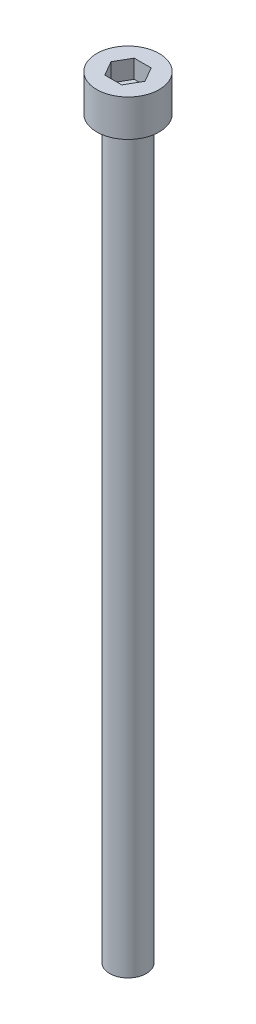
ISO-10303-21;
HEADER;
FILE_DESCRIPTION(('STEP AP214'),'2;1');
FILE_NAME('part.step','',(''),(''),'','','');
FILE_SCHEMA(('AUTOMOTIVE_DESIGN { 1 0 10303 214 1 1 1 1 }'));
ENDSEC;
DATA;
#1=APPLICATION_CONTEXT('core data for automotive mechanical design processes');
#2=APPLICATION_PROTOCOL_DEFINITION('international standard','automotive_design',2000,#1);
#3=PRODUCT_CONTEXT('',#1,'mechanical');
#4=PRODUCT('Part','Part','',(#3));
#5=PRODUCT_RELATED_PRODUCT_CATEGORY('part','',(#4));
#6=PRODUCT_DEFINITION_FORMATION('','',#4);
#7=PRODUCT_DEFINITION_CONTEXT('part definition',#1,'design');
#8=PRODUCT_DEFINITION('design','',#6,#7);
#9=PRODUCT_DEFINITION_SHAPE('','',#8);
#10=(LENGTH_UNIT() NAMED_UNIT(*) SI_UNIT(.MILLI.,.METRE.));
#11=(NAMED_UNIT(*) PLANE_ANGLE_UNIT() SI_UNIT($,.RADIAN.));
#12=(NAMED_UNIT(*) SI_UNIT($,.STERADIAN.) SOLID_ANGLE_UNIT());
#13=UNCERTAINTY_MEASURE_WITH_UNIT(LENGTH_MEASURE(1.E-05),#10,'distance_accuracy_value','');
#14=(GEOMETRIC_REPRESENTATION_CONTEXT(3) GLOBAL_UNCERTAINTY_ASSIGNED_CONTEXT((#13)) GLOBAL_UNIT_ASSIGNED_CONTEXT((#10,
#11,#12)) REPRESENTATION_CONTEXT('',''));
#15=CARTESIAN_POINT('',(0.,0.,0.));
#16=DIRECTION('',(0.,0.,1.));
#17=DIRECTION('',(1.,0.,0.));
#18=AXIS2_PLACEMENT_3D('',#15,#16,#17);
#19=CARTESIAN_POINT('',(0.,5.,0.));
#20=DIRECTION('',(0.,-1.,0.));
#21=DIRECTION('',(0.,0.,-1.));
#22=AXIS2_PLACEMENT_3D('',#19,#20,#21);
#23=CYLINDRICAL_SURFACE('',#22,4.25);
#24=CARTESIAN_POINT('',(0.,5.,0.));
#25=DIRECTION('',(0.,1.,0.));
#26=DIRECTION('',(0.,0.,1.));
#27=AXIS2_PLACEMENT_3D('',#24,#25,#26);
#28=CIRCLE('',#27,4.25);
#29=CARTESIAN_POINT('',(0.,5.,4.25));
#30=VERTEX_POINT('',#29);
#31=EDGE_CURVE('E43',#30,#30,#28,.T.);
#32=ORIENTED_EDGE('',*,*,#31,.F.);
#33=EDGE_LOOP('',(#32));
#34=FACE_BOUND('',#33,.T.);
#35=CARTESIAN_POINT('',(0.,0.,0.));
#36=DIRECTION('',(0.,1.,0.));
#37=DIRECTION('',(0.,0.,1.));
#38=AXIS2_PLACEMENT_3D('',#35,#36,#37);
#39=CIRCLE('',#38,4.25);
#40=CARTESIAN_POINT('',(0.,0.,4.25));
#41=VERTEX_POINT('',#40);
#42=EDGE_CURVE('E38',#41,#41,#39,.T.);
#43=ORIENTED_EDGE('',*,*,#42,.T.);
#44=EDGE_LOOP('',(#43));
#45=FACE_BOUND('',#44,.T.);
#46=ADVANCED_FACE('F35',(#34,#45),#23,.T.);
#47=CARTESIAN_POINT('',(0.,5.,0.));
#48=DIRECTION('',(0.,1.,0.));
#49=DIRECTION('',(0.,0.,1.));
#50=AXIS2_PLACEMENT_3D('',#47,#48,#49);
#51=PLANE('',#50);
#52=DIRECTION('',(0.5,0.,-0.866025403784439));
#53=VECTOR('',#52,1.);
#54=CARTESIAN_POINT('',(1.15470053837925,5.,2.));
#55=LINE('',#54,#53);
#56=CARTESIAN_POINT('',(1.15470053837925,5.,2.));
#57=VERTEX_POINT('',#56);
#58=CARTESIAN_POINT('',(2.3094010767585,5.,0.));
#59=VERTEX_POINT('',#58);
#60=EDGE_CURVE('E51',#57,#59,#55,.T.);
#61=ORIENTED_EDGE('',*,*,#60,.F.);
#62=DIRECTION('',(1.,0.,0.));
#63=VECTOR('',#62,1.);
#64=CARTESIAN_POINT('',(-1.15470053837925,5.,2.));
#65=LINE('',#64,#63);
#66=CARTESIAN_POINT('',(-1.15470053837925,5.,2.));
#67=VERTEX_POINT('',#66);
#68=EDGE_CURVE('E135',#67,#57,#65,.T.);
#69=ORIENTED_EDGE('',*,*,#68,.F.);
#70=DIRECTION('',(0.5,0.,0.866025403784438));
#71=VECTOR('',#70,1.);
#72=CARTESIAN_POINT('',(-2.3094010767585,5.,0.));
#73=LINE('',#72,#71);
#74=CARTESIAN_POINT('',(-2.3094010767585,5.,0.));
#75=VERTEX_POINT('',#74);
#76=EDGE_CURVE('E133',#75,#67,#73,.T.);
#77=ORIENTED_EDGE('',*,*,#76,.F.);
#78=DIRECTION('',(-0.5,0.,0.866025403784439));
#79=VECTOR('',#78,1.);
#80=CARTESIAN_POINT('',(-1.15470053837925,5.,-2.));
#81=LINE('',#80,#79);
#82=CARTESIAN_POINT('',(-1.15470053837925,5.,-2.));
#83=VERTEX_POINT('',#82);
#84=EDGE_CURVE('E99',#83,#75,#81,.T.);
#85=ORIENTED_EDGE('',*,*,#84,.F.);
#86=DIRECTION('',(-1.,0.,0.));
#87=VECTOR('',#86,1.);
#88=CARTESIAN_POINT('',(1.15470053837925,5.,-2.));
#89=LINE('',#88,#87);
#90=CARTESIAN_POINT('',(1.15470053837925,5.,-2.));
#91=VERTEX_POINT('',#90);
#92=EDGE_CURVE('E129',#91,#83,#89,.T.);
#93=ORIENTED_EDGE('',*,*,#92,.F.);
#94=DIRECTION('',(-0.5,0.,-0.866025403784438));
#95=VECTOR('',#94,1.);
#96=CARTESIAN_POINT('',(2.3094010767585,5.,0.));
#97=LINE('',#96,#95);
#98=EDGE_CURVE('E125',#59,#91,#97,.T.);
#99=ORIENTED_EDGE('',*,*,#98,.F.);
#100=EDGE_LOOP('',(#61,#69,#77,#85,#93,#99));
#101=FACE_BOUND('',#100,.T.);
#102=ORIENTED_EDGE('',*,*,#31,.T.);
#103=EDGE_LOOP('',(#102));
#104=FACE_BOUND('',#103,.T.);
#105=ADVANCED_FACE('F153',(#101,#104),#51,.T.);
#106=CARTESIAN_POINT('',(0.,0.,0.));
#107=DIRECTION('',(0.,1.,0.));
#108=DIRECTION('',(0.,0.,1.));
#109=AXIS2_PLACEMENT_3D('',#106,#107,#108);
#110=PLANE('',#109);
#111=CARTESIAN_POINT('',(0.,0.,0.));
#112=DIRECTION('',(0.,-1.,0.));
#113=DIRECTION('',(0.,0.,-1.));
#114=AXIS2_PLACEMENT_3D('',#111,#112,#113);
#115=CIRCLE('',#114,2.5);
#116=CARTESIAN_POINT('',(0.,0.,-2.5));
#117=VERTEX_POINT('',#116);
#118=EDGE_CURVE('E11',#117,#117,#115,.T.);
#119=ORIENTED_EDGE('',*,*,#118,.F.);
#120=EDGE_LOOP('',(#119));
#121=FACE_BOUND('',#120,.T.);
#122=ORIENTED_EDGE('',*,*,#42,.F.);
#123=EDGE_LOOP('',(#122));
#124=FACE_BOUND('',#123,.T.);
#125=ADVANCED_FACE('F150',(#121,#124),#110,.F.);
#126=CARTESIAN_POINT('',(1.15470053837925,2.5,2.));
#127=DIRECTION('',(0.866025403784439,0.,0.5));
#128=DIRECTION('',(0.5,0.,-0.866025403784439));
#129=AXIS2_PLACEMENT_3D('',#126,#127,#128);
#130=PLANE('',#129);
#131=ORIENTED_EDGE('',*,*,#60,.T.);
#132=DIRECTION('',(0.,1.,0.));
#133=VECTOR('',#132,1.);
#134=CARTESIAN_POINT('',(2.3094010767585,2.5,0.));
#135=LINE('',#134,#133);
#136=CARTESIAN_POINT('',(2.3094010767585,2.5,0.));
#137=VERTEX_POINT('',#136);
#138=EDGE_CURVE('E81',#137,#59,#135,.T.);
#139=ORIENTED_EDGE('',*,*,#138,.F.);
#140=DIRECTION('',(0.5,0.,-0.866025403784439));
#141=VECTOR('',#140,1.);
#142=CARTESIAN_POINT('',(1.15470053837925,2.5,2.));
#143=LINE('',#142,#141);
#144=CARTESIAN_POINT('',(1.15470053837925,2.5,2.));
#145=VERTEX_POINT('',#144);
#146=EDGE_CURVE('E137',#145,#137,#143,.T.);
#147=ORIENTED_EDGE('',*,*,#146,.F.);
#148=DIRECTION('',(0.,1.,0.));
#149=VECTOR('',#148,1.);
#150=CARTESIAN_POINT('',(1.15470053837925,2.5,2.));
#151=LINE('',#150,#149);
#152=EDGE_CURVE('E59',#145,#57,#151,.T.);
#153=ORIENTED_EDGE('',*,*,#152,.T.);
#154=EDGE_LOOP('',(#131,#139,#147,#153));
#155=FACE_BOUND('',#154,.T.);
#156=ADVANCED_FACE('F152',(#155),#130,.F.);
#157=CARTESIAN_POINT('',(-1.15470053837925,2.5,2.));
#158=DIRECTION('',(0.,0.,1.));
#159=DIRECTION('',(1.,0.,0.));
#160=AXIS2_PLACEMENT_3D('',#157,#158,#159);
#161=PLANE('',#160);
#162=ORIENTED_EDGE('',*,*,#68,.T.);
#163=ORIENTED_EDGE('',*,*,#152,.F.);
#164=DIRECTION('',(1.,0.,0.));
#165=VECTOR('',#164,1.);
#166=CARTESIAN_POINT('',(-1.15470053837925,2.5,2.));
#167=LINE('',#166,#165);
#168=CARTESIAN_POINT('',(-1.15470053837925,2.5,2.));
#169=VERTEX_POINT('',#168);
#170=EDGE_CURVE('E111',#169,#145,#167,.T.);
#171=ORIENTED_EDGE('',*,*,#170,.F.);
#172=DIRECTION('',(0.,1.,0.));
#173=VECTOR('',#172,1.);
#174=CARTESIAN_POINT('',(-1.15470053837925,2.5,2.));
#175=LINE('',#174,#173);
#176=EDGE_CURVE('E103',#169,#67,#175,.T.);
#177=ORIENTED_EDGE('',*,*,#176,.T.);
#178=EDGE_LOOP('',(#162,#163,#171,#177));
#179=FACE_BOUND('',#178,.T.);
#180=ADVANCED_FACE('F159',(#179),#161,.F.);
#181=CARTESIAN_POINT('',(-2.3094010767585,2.5,0.));
#182=DIRECTION('',(-0.866025403784439,0.,0.5));
#183=DIRECTION('',(0.5,0.,0.866025403784439));
#184=AXIS2_PLACEMENT_3D('',#181,#182,#183);
#185=PLANE('',#184);
#186=ORIENTED_EDGE('',*,*,#76,.T.);
#187=ORIENTED_EDGE('',*,*,#176,.F.);
#188=DIRECTION('',(0.5,0.,0.866025403784438));
#189=VECTOR('',#188,1.);
#190=CARTESIAN_POINT('',(-2.3094010767585,2.5,0.));
#191=LINE('',#190,#189);
#192=CARTESIAN_POINT('',(-2.3094010767585,2.5,0.));
#193=VERTEX_POINT('',#192);
#194=EDGE_CURVE('E107',#193,#169,#191,.T.);
#195=ORIENTED_EDGE('',*,*,#194,.F.);
#196=DIRECTION('',(0.,1.,0.));
#197=VECTOR('',#196,1.);
#198=CARTESIAN_POINT('',(-2.3094010767585,2.5,0.));
#199=LINE('',#198,#197);
#200=EDGE_CURVE('E92',#193,#75,#199,.T.);
#201=ORIENTED_EDGE('',*,*,#200,.T.);
#202=EDGE_LOOP('',(#186,#187,#195,#201));
#203=FACE_BOUND('',#202,.T.);
#204=ADVANCED_FACE('F108',(#203),#185,.F.);
#205=CARTESIAN_POINT('',(-1.15470053837925,2.5,-2.));
#206=DIRECTION('',(-0.866025403784439,0.,-0.5));
#207=DIRECTION('',(-0.5,0.,0.866025403784439));
#208=AXIS2_PLACEMENT_3D('',#205,#206,#207);
#209=PLANE('',#208);
#210=ORIENTED_EDGE('',*,*,#84,.T.);
#211=ORIENTED_EDGE('',*,*,#200,.F.);
#212=DIRECTION('',(-0.5,0.,0.866025403784439));
#213=VECTOR('',#212,1.);
#214=CARTESIAN_POINT('',(-1.15470053837925,2.5,-2.));
#215=LINE('',#214,#213);
#216=CARTESIAN_POINT('',(-1.15470053837925,2.5,-2.));
#217=VERTEX_POINT('',#216);
#218=EDGE_CURVE('E96',#217,#193,#215,.T.);
#219=ORIENTED_EDGE('',*,*,#218,.F.);
#220=DIRECTION('',(0.,1.,0.));
#221=VECTOR('',#220,1.);
#222=CARTESIAN_POINT('',(-1.15470053837925,2.5,-2.));
#223=LINE('',#222,#221);
#224=EDGE_CURVE('E104',#217,#83,#223,.T.);
#225=ORIENTED_EDGE('',*,*,#224,.T.);
#226=EDGE_LOOP('',(#210,#211,#219,#225));
#227=FACE_BOUND('',#226,.T.);
#228=ADVANCED_FACE('F94',(#227),#209,.F.);
#229=CARTESIAN_POINT('',(1.15470053837925,2.5,-2.));
#230=DIRECTION('',(0.,0.,-1.));
#231=DIRECTION('',(-1.,0.,0.));
#232=AXIS2_PLACEMENT_3D('',#229,#230,#231);
#233=PLANE('',#232);
#234=ORIENTED_EDGE('',*,*,#92,.T.);
#235=ORIENTED_EDGE('',*,*,#224,.F.);
#236=DIRECTION('',(-1.,0.,0.));
#237=VECTOR('',#236,1.);
#238=CARTESIAN_POINT('',(1.15470053837925,2.5,-2.));
#239=LINE('',#238,#237);
#240=CARTESIAN_POINT('',(1.15470053837925,2.5,-2.));
#241=VERTEX_POINT('',#240);
#242=EDGE_CURVE('E117',#241,#217,#239,.T.);
#243=ORIENTED_EDGE('',*,*,#242,.F.);
#244=DIRECTION('',(0.,1.,0.));
#245=VECTOR('',#244,1.);
#246=CARTESIAN_POINT('',(1.15470053837925,2.5,-2.));
#247=LINE('',#246,#245);
#248=EDGE_CURVE('E141',#241,#91,#247,.T.);
#249=ORIENTED_EDGE('',*,*,#248,.T.);
#250=EDGE_LOOP('',(#234,#235,#243,#249));
#251=FACE_BOUND('',#250,.T.);
#252=ADVANCED_FACE('F204',(#251),#233,.F.);
#253=CARTESIAN_POINT('',(2.3094010767585,2.5,0.));
#254=DIRECTION('',(0.866025403784438,0.,-0.5));
#255=DIRECTION('',(-0.5,0.,-0.866025403784439));
#256=AXIS2_PLACEMENT_3D('',#253,#254,#255);
#257=PLANE('',#256);
#258=ORIENTED_EDGE('',*,*,#98,.T.);
#259=ORIENTED_EDGE('',*,*,#248,.F.);
#260=DIRECTION('',(-0.5,0.,-0.866025403784438));
#261=VECTOR('',#260,1.);
#262=CARTESIAN_POINT('',(2.3094010767585,2.5,0.));
#263=LINE('',#262,#261);
#264=EDGE_CURVE('E119',#137,#241,#263,.T.);
#265=ORIENTED_EDGE('',*,*,#264,.F.);
#266=ORIENTED_EDGE('',*,*,#138,.T.);
#267=EDGE_LOOP('',(#258,#259,#265,#266));
#268=FACE_BOUND('',#267,.T.);
#269=ADVANCED_FACE('F213',(#268),#257,.F.);
#270=CARTESIAN_POINT('',(0.,2.5,0.));
#271=DIRECTION('',(0.,1.,0.));
#272=DIRECTION('',(0.,0.,1.));
#273=AXIS2_PLACEMENT_3D('',#270,#271,#272);
#274=PLANE('',#273);
#275=ORIENTED_EDGE('',*,*,#146,.T.);
#276=ORIENTED_EDGE('',*,*,#264,.T.);
#277=ORIENTED_EDGE('',*,*,#242,.T.);
#278=ORIENTED_EDGE('',*,*,#218,.T.);
#279=ORIENTED_EDGE('',*,*,#194,.T.);
#280=ORIENTED_EDGE('',*,*,#170,.T.);
#281=EDGE_LOOP('',(#275,#276,#277,#278,#279,#280));
#282=FACE_BOUND('',#281,.T.);
#283=ADVANCED_FACE('F114',(#282),#274,.T.);
#284=CARTESIAN_POINT('',(0.,-100.,0.));
#285=DIRECTION('',(0.,1.,0.));
#286=DIRECTION('',(0.,0.,1.));
#287=AXIS2_PLACEMENT_3D('',#284,#285,#286);
#288=CYLINDRICAL_SURFACE('',#287,2.5);
#289=CARTESIAN_POINT('',(0.,-100.,0.));
#290=DIRECTION('',(0.,-1.,0.));
#291=DIRECTION('',(0.,0.,-1.));
#292=AXIS2_PLACEMENT_3D('',#289,#290,#291);
#293=CIRCLE('',#292,2.5);
#294=CARTESIAN_POINT('',(0.,-100.,-2.5));
#295=VERTEX_POINT('',#294);
#296=EDGE_CURVE('E126',#295,#295,#293,.T.);
#297=ORIENTED_EDGE('',*,*,#296,.F.);
#298=EDGE_LOOP('',(#297));
#299=FACE_BOUND('',#298,.T.);
#300=ORIENTED_EDGE('',*,*,#118,.T.);
#301=EDGE_LOOP('',(#300));
#302=FACE_BOUND('',#301,.T.);
#303=ADVANCED_FACE('F231',(#299,#302),#288,.T.);
#304=CARTESIAN_POINT('',(0.,-100.,0.));
#305=DIRECTION('',(0.,-1.,0.));
#306=DIRECTION('',(0.,0.,-1.));
#307=AXIS2_PLACEMENT_3D('',#304,#305,#306);
#308=PLANE('',#307);
#309=ORIENTED_EDGE('',*,*,#296,.T.);
#310=EDGE_LOOP('',(#309));
#311=FACE_BOUND('',#310,.T.);
#312=ADVANCED_FACE('F244',(#311),#308,.T.);
#313=CLOSED_SHELL('',(#46,#105,#125,#156,#180,#204,#228,#252,#269,#283,#303,#312));
#314=MANIFOLD_SOLID_BREP('B2',#313);
#315=ADVANCED_BREP_SHAPE_REPRESENTATION('',(#18,#314),#14);
#316=SHAPE_DEFINITION_REPRESENTATION(#9,#315);
ENDSEC;
END-ISO-10303-21;
